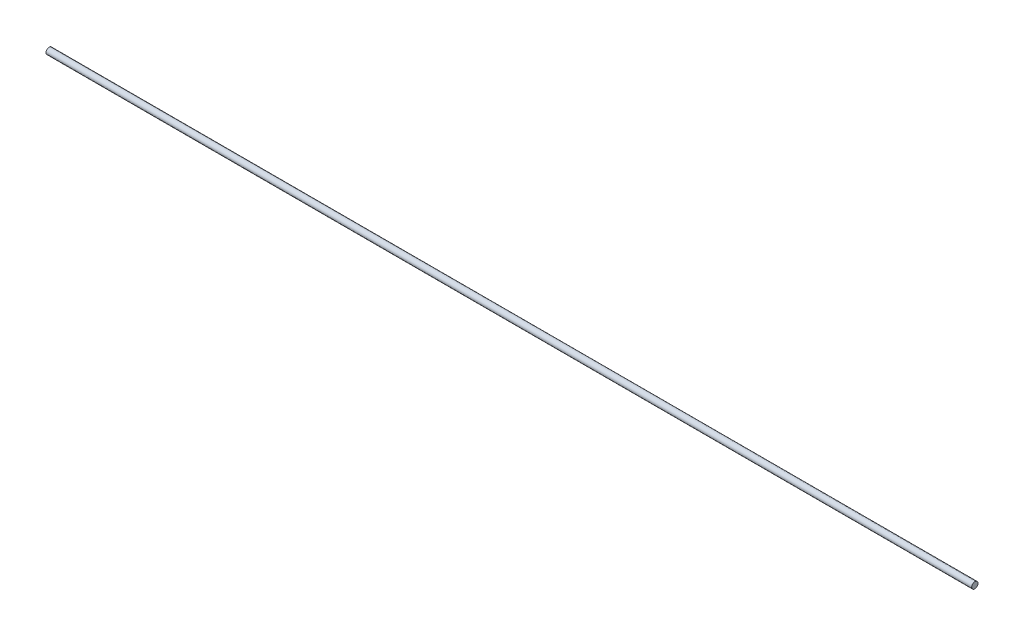
ISO-10303-21;
HEADER;
FILE_DESCRIPTION(('STEP AP214'),'2;1');
FILE_NAME('part.step','',(''),(''),'','','');
FILE_SCHEMA(('AUTOMOTIVE_DESIGN { 1 0 10303 214 1 1 1 1 }'));
ENDSEC;
DATA;
#1=APPLICATION_CONTEXT('core data for automotive mechanical design processes');
#2=APPLICATION_PROTOCOL_DEFINITION('international standard','automotive_design',2000,#1);
#3=PRODUCT_CONTEXT('',#1,'mechanical');
#4=PRODUCT('Part','Part','',(#3));
#5=PRODUCT_RELATED_PRODUCT_CATEGORY('part','',(#4));
#6=PRODUCT_DEFINITION_FORMATION('','',#4);
#7=PRODUCT_DEFINITION_CONTEXT('part definition',#1,'design');
#8=PRODUCT_DEFINITION('design','',#6,#7);
#9=PRODUCT_DEFINITION_SHAPE('','',#8);
#10=(LENGTH_UNIT() NAMED_UNIT(*) SI_UNIT(.MILLI.,.METRE.));
#11=(NAMED_UNIT(*) PLANE_ANGLE_UNIT() SI_UNIT($,.RADIAN.));
#12=(NAMED_UNIT(*) SI_UNIT($,.STERADIAN.) SOLID_ANGLE_UNIT());
#13=UNCERTAINTY_MEASURE_WITH_UNIT(LENGTH_MEASURE(1.E-05),#10,'distance_accuracy_value','');
#14=(GEOMETRIC_REPRESENTATION_CONTEXT(3) GLOBAL_UNCERTAINTY_ASSIGNED_CONTEXT((#13)) GLOBAL_UNIT_ASSIGNED_CONTEXT((#10,
#11,#12)) REPRESENTATION_CONTEXT('',''));
#15=CARTESIAN_POINT('',(0.,0.,0.));
#16=DIRECTION('',(0.,0.,1.));
#17=DIRECTION('',(1.,0.,0.));
#18=AXIS2_PLACEMENT_3D('',#15,#16,#17);
#19=CARTESIAN_POINT('',(295.,0.,0.));
#20=DIRECTION('',(-1.,0.,0.));
#21=DIRECTION('',(0.,0.,1.));
#22=AXIS2_PLACEMENT_3D('',#19,#20,#21);
#23=CYLINDRICAL_SURFACE('',#22,1.);
#24=CARTESIAN_POINT('',(295.,0.,0.));
#25=DIRECTION('',(1.,0.,0.));
#26=DIRECTION('',(0.,0.,-1.));
#27=AXIS2_PLACEMENT_3D('',#24,#25,#26);
#28=CIRCLE('',#27,1.);
#29=CARTESIAN_POINT('',(295.,0.,-1.));
#30=VERTEX_POINT('',#29);
#31=EDGE_CURVE('E10',#30,#30,#28,.T.);
#32=ORIENTED_EDGE('',*,*,#31,.F.);
#33=EDGE_LOOP('',(#32));
#34=FACE_BOUND('',#33,.T.);
#35=CARTESIAN_POINT('',(0.,0.,0.));
#36=DIRECTION('',(1.,0.,0.));
#37=DIRECTION('',(0.,0.,-1.));
#38=AXIS2_PLACEMENT_3D('',#35,#36,#37);
#39=CIRCLE('',#38,1.);
#40=CARTESIAN_POINT('',(0.,0.,-1.));
#41=VERTEX_POINT('',#40);
#42=EDGE_CURVE('E38',#41,#41,#39,.T.);
#43=ORIENTED_EDGE('',*,*,#42,.T.);
#44=EDGE_LOOP('',(#43));
#45=FACE_BOUND('',#44,.T.);
#46=ADVANCED_FACE('F35',(#34,#45),#23,.T.);
#47=CARTESIAN_POINT('',(295.,0.,0.));
#48=DIRECTION('',(1.,0.,0.));
#49=DIRECTION('',(0.,0.,-1.));
#50=AXIS2_PLACEMENT_3D('',#47,#48,#49);
#51=PLANE('',#50);
#52=ORIENTED_EDGE('',*,*,#31,.T.);
#53=EDGE_LOOP('',(#52));
#54=FACE_BOUND('',#53,.T.);
#55=ADVANCED_FACE('F52',(#54),#51,.T.);
#56=CARTESIAN_POINT('',(0.,0.,0.));
#57=DIRECTION('',(1.,0.,0.));
#58=DIRECTION('',(0.,0.,-1.));
#59=AXIS2_PLACEMENT_3D('',#56,#57,#58);
#60=PLANE('',#59);
#61=ORIENTED_EDGE('',*,*,#42,.F.);
#62=EDGE_LOOP('',(#61));
#63=FACE_BOUND('',#62,.T.);
#64=ADVANCED_FACE('F50',(#63),#60,.F.);
#65=CLOSED_SHELL('',(#46,#55,#64));
#66=MANIFOLD_SOLID_BREP('B2',#65);
#67=ADVANCED_BREP_SHAPE_REPRESENTATION('',(#18,#66),#14);
#68=SHAPE_DEFINITION_REPRESENTATION(#9,#67);
ENDSEC;
END-ISO-10303-21;
